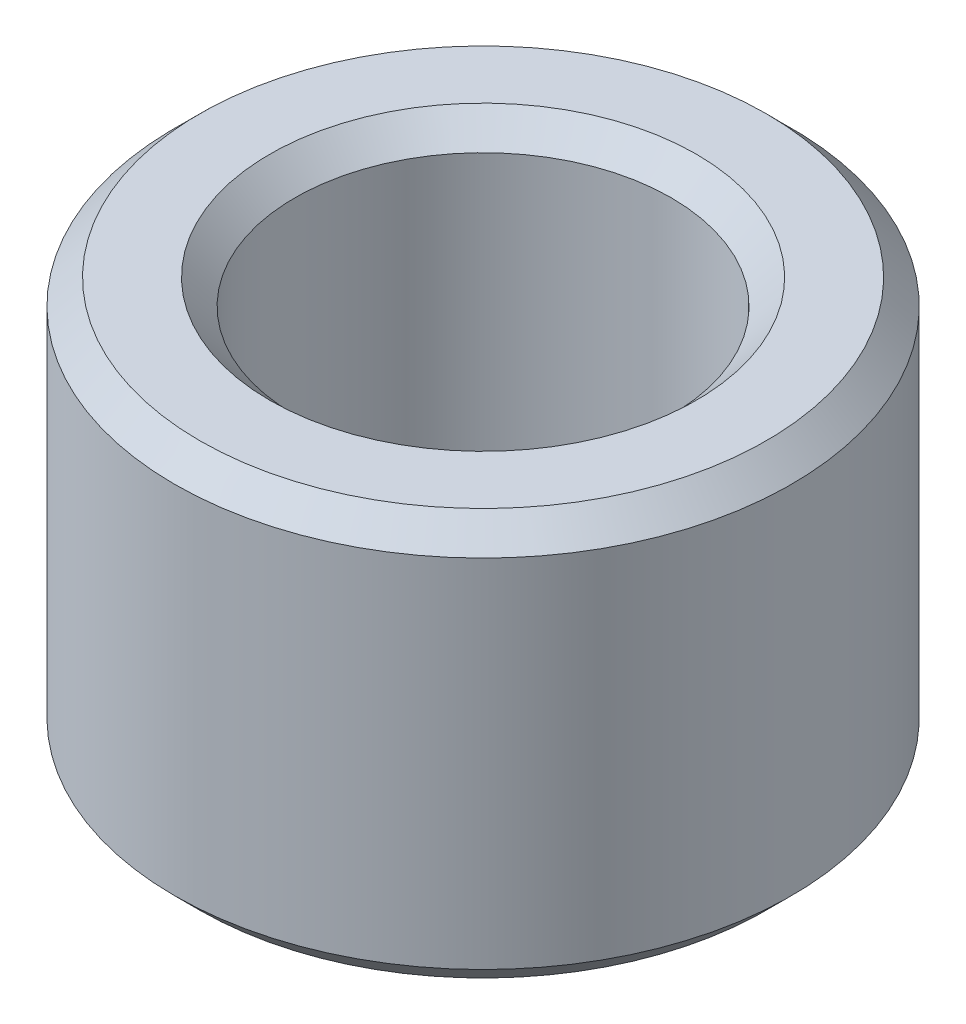
ISO-10303-21;
HEADER;
FILE_DESCRIPTION(('STEP AP214'),'2;1');
FILE_NAME('part.step','',(''),(''),'','','');
FILE_SCHEMA(('AUTOMOTIVE_DESIGN { 1 0 10303 214 1 1 1 1 }'));
ENDSEC;
DATA;
#1=APPLICATION_CONTEXT('core data for automotive mechanical design processes');
#2=APPLICATION_PROTOCOL_DEFINITION('international standard','automotive_design',2000,#1);
#3=PRODUCT_CONTEXT('',#1,'mechanical');
#4=PRODUCT('Part','Part','',(#3));
#5=PRODUCT_RELATED_PRODUCT_CATEGORY('part','',(#4));
#6=PRODUCT_DEFINITION_FORMATION('','',#4);
#7=PRODUCT_DEFINITION_CONTEXT('part definition',#1,'design');
#8=PRODUCT_DEFINITION('design','',#6,#7);
#9=PRODUCT_DEFINITION_SHAPE('','',#8);
#10=(LENGTH_UNIT() NAMED_UNIT(*) SI_UNIT(.MILLI.,.METRE.));
#11=(NAMED_UNIT(*) PLANE_ANGLE_UNIT() SI_UNIT($,.RADIAN.));
#12=(NAMED_UNIT(*) SI_UNIT($,.STERADIAN.) SOLID_ANGLE_UNIT());
#13=UNCERTAINTY_MEASURE_WITH_UNIT(LENGTH_MEASURE(1.E-05),#10,'distance_accuracy_value','');
#14=(GEOMETRIC_REPRESENTATION_CONTEXT(3) GLOBAL_UNCERTAINTY_ASSIGNED_CONTEXT((#13)) GLOBAL_UNIT_ASSIGNED_CONTEXT((#10,
#11,#12)) REPRESENTATION_CONTEXT('',''));
#15=CARTESIAN_POINT('',(0.,0.,0.));
#16=DIRECTION('',(0.,0.,1.));
#17=DIRECTION('',(1.,0.,0.));
#18=AXIS2_PLACEMENT_3D('',#15,#16,#17);
#19=CARTESIAN_POINT('',(0.,62.6267978353039,0.));
#20=DIRECTION('',(0.,-1.,0.));
#21=DIRECTION('',(0.,0.,-1.));
#22=AXIS2_PLACEMENT_3D('',#19,#20,#21);
#23=CYLINDRICAL_SURFACE('',#22,47.5);
#24=CARTESIAN_POINT('',(0.,3.8746307042329,0.));
#25=DIRECTION('',(0.,1.,0.));
#26=DIRECTION('',(0.,0.,1.));
#27=AXIS2_PLACEMENT_3D('',#24,#25,#26);
#28=CIRCLE('',#27,47.5);
#29=CARTESIAN_POINT('',(0.,3.8746307042329,47.5));
#30=VERTEX_POINT('',#29);
#31=EDGE_CURVE('E10',#30,#30,#28,.T.);
#32=ORIENTED_EDGE('',*,*,#31,.T.);
#33=EDGE_LOOP('',(#32));
#34=FACE_BOUND('',#33,.T.);
#35=CARTESIAN_POINT('',(0.,58.7521671310711,0.));
#36=DIRECTION('',(0.,1.,0.));
#37=DIRECTION('',(0.,0.,1.));
#38=AXIS2_PLACEMENT_3D('',#35,#36,#37);
#39=CIRCLE('',#38,47.5);
#40=CARTESIAN_POINT('',(0.,58.7521671310711,47.5));
#41=VERTEX_POINT('',#40);
#42=EDGE_CURVE('E50',#41,#41,#39,.F.);
#43=ORIENTED_EDGE('',*,*,#42,.T.);
#44=EDGE_LOOP('',(#43));
#45=FACE_BOUND('',#44,.T.);
#46=ADVANCED_FACE('F39',(#34,#45),#23,.T.);
#47=CARTESIAN_POINT('',(0.,62.6267978353039,0.));
#48=DIRECTION('',(0.,1.,0.));
#49=DIRECTION('',(0.,0.,1.));
#50=AXIS2_PLACEMENT_3D('',#47,#48,#49);
#51=PLANE('',#50);
#52=CARTESIAN_POINT('',(0.,62.6267978353039,0.));
#53=DIRECTION('',(0.,1.,0.));
#54=DIRECTION('',(0.,0.,1.));
#55=AXIS2_PLACEMENT_3D('',#52,#53,#54);
#56=CIRCLE('',#55,32.8449652071089);
#57=CARTESIAN_POINT('',(0.,62.6267978353039,32.8449652071089));
#58=VERTEX_POINT('',#57);
#59=EDGE_CURVE('E58',#58,#58,#56,.F.);
#60=ORIENTED_EDGE('',*,*,#59,.T.);
#61=EDGE_LOOP('',(#60));
#62=FACE_BOUND('',#61,.T.);
#63=CARTESIAN_POINT('',(0.,62.6267978353039,0.));
#64=DIRECTION('',(0.,1.,0.));
#65=DIRECTION('',(0.,0.,1.));
#66=AXIS2_PLACEMENT_3D('',#63,#64,#65);
#67=CIRCLE('',#66,43.6253692957671);
#68=CARTESIAN_POINT('',(0.,62.6267978353039,43.6253692957671));
#69=VERTEX_POINT('',#68);
#70=EDGE_CURVE('E61',#69,#69,#67,.T.);
#71=ORIENTED_EDGE('',*,*,#70,.T.);
#72=EDGE_LOOP('',(#71));
#73=FACE_BOUND('',#72,.T.);
#74=ADVANCED_FACE('F88',(#62,#73),#51,.T.);
#75=CARTESIAN_POINT('',(0.,0.,0.));
#76=DIRECTION('',(0.,1.,0.));
#77=DIRECTION('',(0.,0.,1.));
#78=AXIS2_PLACEMENT_3D('',#75,#76,#77);
#79=PLANE('',#78);
#80=CARTESIAN_POINT('',(0.,0.,0.));
#81=DIRECTION('',(0.,1.,0.));
#82=DIRECTION('',(0.,0.,1.));
#83=AXIS2_PLACEMENT_3D('',#80,#81,#82);
#84=CIRCLE('',#83,32.8449652071088);
#85=CARTESIAN_POINT('',(0.,0.,32.8449652071088));
#86=VERTEX_POINT('',#85);
#87=EDGE_CURVE('E51',#86,#86,#84,.T.);
#88=ORIENTED_EDGE('',*,*,#87,.T.);
#89=EDGE_LOOP('',(#88));
#90=FACE_BOUND('',#89,.T.);
#91=CARTESIAN_POINT('',(0.,0.,0.));
#92=DIRECTION('',(0.,1.,0.));
#93=DIRECTION('',(0.,0.,1.));
#94=AXIS2_PLACEMENT_3D('',#91,#92,#93);
#95=CIRCLE('',#94,43.6253692957671);
#96=CARTESIAN_POINT('',(0.,0.,43.6253692957671));
#97=VERTEX_POINT('',#96);
#98=EDGE_CURVE('E54',#97,#97,#95,.F.);
#99=ORIENTED_EDGE('',*,*,#98,.T.);
#100=EDGE_LOOP('',(#99));
#101=FACE_BOUND('',#100,.T.);
#102=ADVANCED_FACE('F83',(#90,#101),#79,.F.);
#103=CARTESIAN_POINT('',(0.,62.6267978353039,0.));
#104=DIRECTION('',(0.,-1.,0.));
#105=DIRECTION('',(0.,0.,-1.));
#106=AXIS2_PLACEMENT_3D('',#103,#104,#105);
#107=CYLINDRICAL_SURFACE('',#106,28.970334502876);
#108=CARTESIAN_POINT('',(0.,58.7521671310711,0.));
#109=DIRECTION('',(0.,1.,0.));
#110=DIRECTION('',(0.,0.,1.));
#111=AXIS2_PLACEMENT_3D('',#108,#109,#110);
#112=CIRCLE('',#111,28.970334502876);
#113=CARTESIAN_POINT('',(0.,58.7521671310711,28.970334502876));
#114=VERTEX_POINT('',#113);
#115=EDGE_CURVE('E67',#114,#114,#112,.T.);
#116=ORIENTED_EDGE('',*,*,#115,.T.);
#117=EDGE_LOOP('',(#116));
#118=FACE_BOUND('',#117,.T.);
#119=CARTESIAN_POINT('',(0.,3.87463070423291,0.));
#120=DIRECTION('',(0.,1.,0.));
#121=DIRECTION('',(0.,0.,1.));
#122=AXIS2_PLACEMENT_3D('',#119,#120,#121);
#123=CIRCLE('',#122,28.970334502876);
#124=CARTESIAN_POINT('',(0.,3.87463070423291,28.970334502876));
#125=VERTEX_POINT('',#124);
#126=EDGE_CURVE('E69',#125,#125,#123,.F.);
#127=ORIENTED_EDGE('',*,*,#126,.T.);
#128=EDGE_LOOP('',(#127));
#129=FACE_BOUND('',#128,.T.);
#130=ADVANCED_FACE('F71',(#118,#129),#107,.F.);
#131=CARTESIAN_POINT('',(0.,58.7521671310711,0.));
#132=DIRECTION('',(0.,1.,0.));
#133=DIRECTION('',(0.,0.,1.));
#134=AXIS2_PLACEMENT_3D('',#131,#132,#133);
#135=CONICAL_SURFACE('',#134,28.970334502876,0.78539816339745);
#136=ORIENTED_EDGE('',*,*,#59,.F.);
#137=EDGE_LOOP('',(#136));
#138=FACE_BOUND('',#137,.T.);
#139=ORIENTED_EDGE('',*,*,#115,.F.);
#140=EDGE_LOOP('',(#139));
#141=FACE_BOUND('',#140,.T.);
#142=ADVANCED_FACE('F77',(#138,#141),#135,.F.);
#143=CARTESIAN_POINT('',(0.,0.,0.));
#144=DIRECTION('',(0.,-1.,0.));
#145=DIRECTION('',(0.,0.,-1.));
#146=AXIS2_PLACEMENT_3D('',#143,#144,#145);
#147=CONICAL_SURFACE('',#146,32.8449652071088,0.785398163397443);
#148=ORIENTED_EDGE('',*,*,#126,.F.);
#149=EDGE_LOOP('',(#148));
#150=FACE_BOUND('',#149,.T.);
#151=ORIENTED_EDGE('',*,*,#87,.F.);
#152=EDGE_LOOP('',(#151));
#153=FACE_BOUND('',#152,.T.);
#154=ADVANCED_FACE('F73',(#150,#153),#147,.F.);
#155=CARTESIAN_POINT('',(0.,3.8746307042329,0.));
#156=DIRECTION('',(0.,1.,0.));
#157=DIRECTION('',(0.,0.,1.));
#158=AXIS2_PLACEMENT_3D('',#155,#156,#157);
#159=CONICAL_SURFACE('',#158,47.5,0.785398163397452);
#160=CARTESIAN_POINT('',(0.,0.,43.6253692957671));
#161=CARTESIAN_POINT('',(0.,0.0403607365024239,43.6657300322695));
#162=CARTESIAN_POINT('',(0.,0.0807214730048505,43.7060907687719));
#163=CARTESIAN_POINT('',(0.,0.161442946009704,43.7868122417768));
#164=CARTESIAN_POINT('',(0.,0.20180368251213,43.8271729782792));
#165=CARTESIAN_POINT('',(0.,0.282525155516982,43.9078944512841));
#166=CARTESIAN_POINT('',(0.,0.322885892019408,43.9482551877865));
#167=CARTESIAN_POINT('',(0.,0.403607365024259,44.0289766607913));
#168=CARTESIAN_POINT('',(0.,0.443968101526685,44.0693373972938));
#169=CARTESIAN_POINT('',(0.,0.524689574531537,44.1500588702986));
#170=CARTESIAN_POINT('',(0.,0.565050311033964,44.1904196068011));
#171=CARTESIAN_POINT('',(0.,0.645771784038817,44.2711410798059));
#172=CARTESIAN_POINT('',(0.,0.686132520541242,44.3115018163083));
#173=CARTESIAN_POINT('',(0.,0.766853993546094,44.3922232893132));
#174=CARTESIAN_POINT('',(0.,0.807214730048519,44.4325840258156));
#175=CARTESIAN_POINT('',(0.,0.887936203053372,44.5133054988205));
#176=CARTESIAN_POINT('',(0.,0.928296939555798,44.5536662353229));
#177=CARTESIAN_POINT('',(0.,1.00901841256065,44.6343877083277));
#178=CARTESIAN_POINT('',(0.,1.04937914906308,44.6747484448302));
#179=CARTESIAN_POINT('',(0.,1.13010062206793,44.755469917835));
#180=CARTESIAN_POINT('',(0.,1.17046135857035,44.7958306543375));
#181=CARTESIAN_POINT('',(0.,1.25118283157521,44.8765521273423));
#182=CARTESIAN_POINT('',(0.,1.29154356807763,44.9169128638447));
#183=CARTESIAN_POINT('',(0.,1.37226504108248,44.9976343368496));
#184=CARTESIAN_POINT('',(0.,1.41262577758491,45.037995073352));
#185=CARTESIAN_POINT('',(0.,1.49334725058976,45.1187165463569));
#186=CARTESIAN_POINT('',(0.,1.53370798709219,45.1590772828593));
#187=CARTESIAN_POINT('',(0.,1.61442946009704,45.2397987558641));
#188=CARTESIAN_POINT('',(0.,1.65479019659947,45.2801594923666));
#189=CARTESIAN_POINT('',(0.,1.73551166960432,45.3608809653714));
#190=CARTESIAN_POINT('',(0.,1.77587240610675,45.4012417018738));
#191=CARTESIAN_POINT('',(0.,1.8565938791116,45.4819631748787));
#192=CARTESIAN_POINT('',(0.,1.89695461561402,45.5223239113811));
#193=CARTESIAN_POINT('',(0.,1.97767608861887,45.603045384386));
#194=CARTESIAN_POINT('',(0.,2.0180368251213,45.6434061208884));
#195=CARTESIAN_POINT('',(0.,2.09875829812615,45.7241275938933));
#196=CARTESIAN_POINT('',(0.,2.13911903462858,45.7644883303957));
#197=CARTESIAN_POINT('',(0.,2.21984050763343,45.8452098034005));
#198=CARTESIAN_POINT('',(0.,2.26020124413586,45.885570539903));
#199=CARTESIAN_POINT('',(0.,2.34092271714071,45.9662920129078));
#200=CARTESIAN_POINT('',(0.,2.38128345364313,46.0066527494102));
#201=CARTESIAN_POINT('',(0.,2.46200492664799,46.0873742224151));
#202=CARTESIAN_POINT('',(0.,2.50236566315041,46.1277349589175));
#203=CARTESIAN_POINT('',(0.,2.58308713615527,46.2084564319224));
#204=CARTESIAN_POINT('',(0.,2.62344787265769,46.2488171684248));
#205=CARTESIAN_POINT('',(0.,2.70416934566254,46.3295386414296));
#206=CARTESIAN_POINT('',(0.,2.74453008216497,46.3698993779321));
#207=CARTESIAN_POINT('',(0.,2.82525155516982,46.4506208509369));
#208=CARTESIAN_POINT('',(0.,2.86561229167225,46.4909815874394));
#209=CARTESIAN_POINT('',(0.,2.9463337646771,46.5717030604442));
#210=CARTESIAN_POINT('',(0.,2.98669450117953,46.6120637969466));
#211=CARTESIAN_POINT('',(0.,3.06741597418438,46.6927852699515));
#212=CARTESIAN_POINT('',(0.,3.1077767106868,46.7331460064539));
#213=CARTESIAN_POINT('',(0.,3.18849818369165,46.8138674794588));
#214=CARTESIAN_POINT('',(0.,3.22885892019408,46.8542282159612));
#215=CARTESIAN_POINT('',(0.,3.30958039319893,46.934949688966));
#216=CARTESIAN_POINT('',(0.,3.34994112970136,46.9753104254685));
#217=CARTESIAN_POINT('',(0.,3.43066260270621,47.0560318984733));
#218=CARTESIAN_POINT('',(0.,3.47102333920864,47.0963926349757));
#219=CARTESIAN_POINT('',(0.,3.55174481221349,47.1771141079806));
#220=CARTESIAN_POINT('',(0.,3.59210554871592,47.217474844483));
#221=CARTESIAN_POINT('',(0.,3.67282702172077,47.2981963174879));
#222=CARTESIAN_POINT('',(0.,3.71318775822319,47.3385570539903));
#223=CARTESIAN_POINT('',(0.,3.79390923122805,47.4192785269952));
#224=CARTESIAN_POINT('',(0.,3.83426996773047,47.4596392634976));
#225=CARTESIAN_POINT('',(0.,3.8746307042329,47.5));
#226=B_SPLINE_CURVE_WITH_KNOTS('',3,(#160,#161,#162,#163,#164,#165,#166,#167,#168,#169,#170,
#171,#172,#173,#174,#175,#176,#177,#178,#179,#180,#181,#182,#183,#184,#185,#186,#187,#188,#189,
#190,#191,#192,#193,#194,#195,#196,#197,#198,#199,#200,#201,#202,#203,#204,#205,#206,#207,#208,
#209,#210,#211,#212,#213,#214,#215,#216,#217,#218,#219,#220,#221,#222,#223,#224,#225),
.UNSPECIFIED.,.F.,.F.,(4,2,2,2,2,2,2,2,2,2,2,2,2,2,2,2,2,2,2,2,2,2,2,2,2,2,2,2,2,2,2,2,4),(0.,
0.171236102847295,0.342472205694586,0.513708308541881,0.684944411389176,0.856180514236467,
1.02741661708376,1.19865271993106,1.36988882277835,1.54112492562564,1.71236102847294,
1.88359713132023,2.05483323416752,2.22606933701482,2.39730543986211,2.56854154270941,
2.7397776455567,2.911013748404,3.08224985125129,3.25348595409858,3.42472205694588,
3.59595815979317,3.76719426264046,3.93843036548776,4.10966646833505,4.28090257118234,
4.45213867402964,4.62337477687693,4.79461087972423,4.96584698257152,5.13708308541881,
5.30831918826611,5.4795552911134),.UNSPECIFIED.);
#227=EDGE_CURVE('BSEAM76',#97,#30,#226,.T.);
#228=ORIENTED_EDGE('',*,*,#98,.F.);
#229=ORIENTED_EDGE('',*,*,#31,.F.);
#230=ORIENTED_EDGE('',*,*,#227,.T.);
#231=ORIENTED_EDGE('',*,*,#227,.F.);
#232=EDGE_LOOP('',(#228,#230,#229,#231));
#233=FACE_BOUND('',#232,.T.);
#234=ADVANCED_FACE('F76',(#233),#159,.T.);
#235=CARTESIAN_POINT('',(0.,62.6267978353039,0.));
#236=DIRECTION('',(0.,-1.,0.));
#237=DIRECTION('',(0.,0.,-1.));
#238=AXIS2_PLACEMENT_3D('',#235,#236,#237);
#239=CONICAL_SURFACE('',#238,43.6253692957671,0.785398163397446);
#240=ORIENTED_EDGE('',*,*,#42,.F.);
#241=EDGE_LOOP('',(#240));
#242=FACE_BOUND('',#241,.T.);
#243=ORIENTED_EDGE('',*,*,#70,.F.);
#244=EDGE_LOOP('',(#243));
#245=FACE_BOUND('',#244,.T.);
#246=ADVANCED_FACE('F45',(#242,#245),#239,.T.);
#247=CLOSED_SHELL('',(#46,#74,#102,#130,#142,#154,#234,#246));
#248=MANIFOLD_SOLID_BREP('B2',#247);
#249=ADVANCED_BREP_SHAPE_REPRESENTATION('',(#18,#248),#14);
#250=SHAPE_DEFINITION_REPRESENTATION(#9,#249);
ENDSEC;
END-ISO-10303-21;
